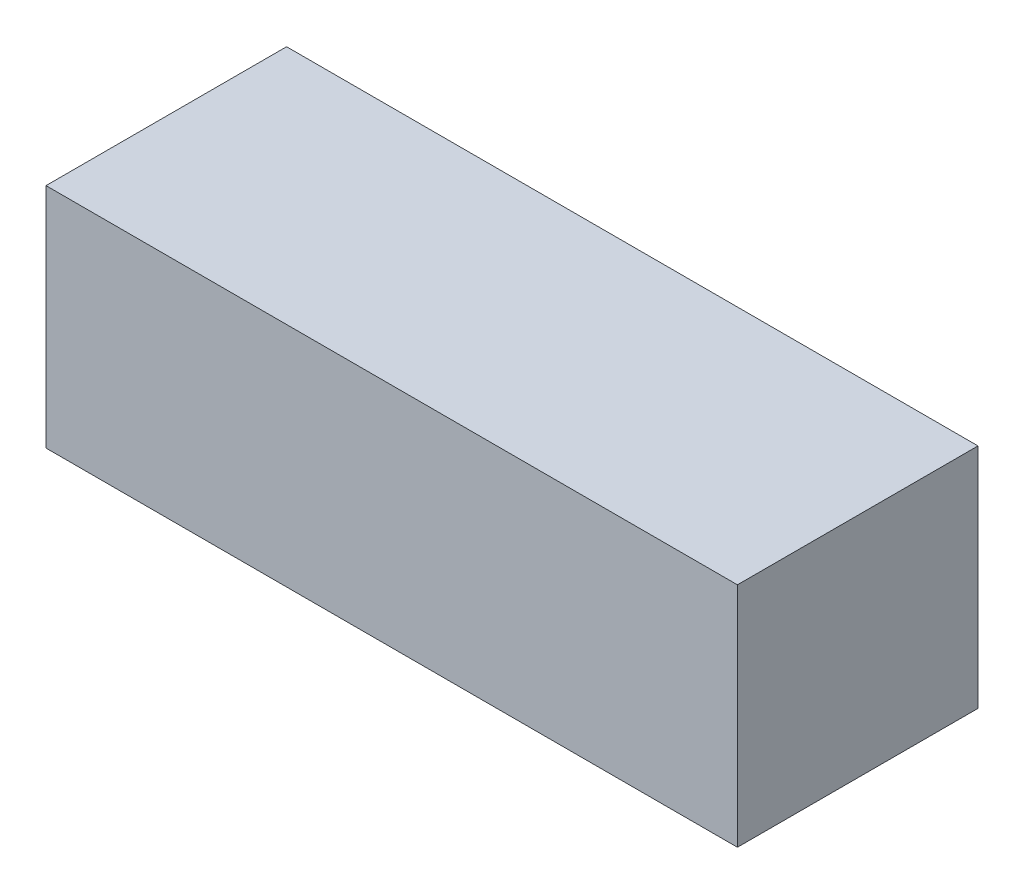
ISO-10303-21;
HEADER;
FILE_DESCRIPTION(('STEP AP214'),'2;1');
FILE_NAME('part.step','',(''),(''),'','','');
FILE_SCHEMA(('AUTOMOTIVE_DESIGN { 1 0 10303 214 1 1 1 1 }'));
ENDSEC;
DATA;
#1=APPLICATION_CONTEXT('core data for automotive mechanical design processes');
#2=APPLICATION_PROTOCOL_DEFINITION('international standard','automotive_design',2000,#1);
#3=PRODUCT_CONTEXT('',#1,'mechanical');
#4=PRODUCT('Part','Part','',(#3));
#5=PRODUCT_RELATED_PRODUCT_CATEGORY('part','',(#4));
#6=PRODUCT_DEFINITION_FORMATION('','',#4);
#7=PRODUCT_DEFINITION_CONTEXT('part definition',#1,'design');
#8=PRODUCT_DEFINITION('design','',#6,#7);
#9=PRODUCT_DEFINITION_SHAPE('','',#8);
#10=(LENGTH_UNIT() NAMED_UNIT(*) SI_UNIT(.MILLI.,.METRE.));
#11=(NAMED_UNIT(*) PLANE_ANGLE_UNIT() SI_UNIT($,.RADIAN.));
#12=(NAMED_UNIT(*) SI_UNIT($,.STERADIAN.) SOLID_ANGLE_UNIT());
#13=UNCERTAINTY_MEASURE_WITH_UNIT(LENGTH_MEASURE(1.E-05),#10,'distance_accuracy_value','');
#14=(GEOMETRIC_REPRESENTATION_CONTEXT(3) GLOBAL_UNCERTAINTY_ASSIGNED_CONTEXT((#13)) GLOBAL_UNIT_ASSIGNED_CONTEXT((#10,
#11,#12)) REPRESENTATION_CONTEXT('',''));
#15=CARTESIAN_POINT('',(0.,0.,0.));
#16=DIRECTION('',(0.,0.,1.));
#17=DIRECTION('',(1.,0.,0.));
#18=AXIS2_PLACEMENT_3D('',#15,#16,#17);
#19=CARTESIAN_POINT('',(-23.1775,-7.62,0.));
#20=DIRECTION('',(0.,1.,0.));
#21=DIRECTION('',(-1.,0.,0.));
#22=AXIS2_PLACEMENT_3D('',#19,#20,#21);
#23=PLANE('',#22);
#24=DIRECTION('',(0.,0.,1.));
#25=VECTOR('',#24,1.);
#26=CARTESIAN_POINT('',(23.1775,-7.62,0.));
#27=LINE('',#26,#25);
#28=CARTESIAN_POINT('',(23.1775,-7.62,0.));
#29=VERTEX_POINT('',#28);
#30=CARTESIAN_POINT('',(23.1775,-7.62,16.129));
#31=VERTEX_POINT('',#30);
#32=EDGE_CURVE('E20',#29,#31,#27,.T.);
#33=ORIENTED_EDGE('',*,*,#32,.T.);
#34=DIRECTION('',(-1.,0.,0.));
#35=VECTOR('',#34,1.);
#36=CARTESIAN_POINT('',(23.1775,-7.62,16.129));
#37=LINE('',#36,#35);
#38=CARTESIAN_POINT('',(-23.1775,-7.62,16.129));
#39=VERTEX_POINT('',#38);
#40=EDGE_CURVE('E55',#31,#39,#37,.T.);
#41=ORIENTED_EDGE('',*,*,#40,.T.);
#42=DIRECTION('',(0.,0.,-1.));
#43=VECTOR('',#42,1.);
#44=CARTESIAN_POINT('',(-23.1775,-7.62,0.));
#45=LINE('',#44,#43);
#46=CARTESIAN_POINT('',(-23.1775,-7.62,0.));
#47=VERTEX_POINT('',#46);
#48=EDGE_CURVE('E74',#39,#47,#45,.T.);
#49=ORIENTED_EDGE('',*,*,#48,.T.);
#50=DIRECTION('',(-1.,0.,0.));
#51=VECTOR('',#50,1.);
#52=CARTESIAN_POINT('',(23.1775,-7.62,0.));
#53=LINE('',#52,#51);
#54=EDGE_CURVE('E66',#29,#47,#53,.T.);
#55=ORIENTED_EDGE('',*,*,#54,.F.);
#56=EDGE_LOOP('',(#33,#41,#49,#55));
#57=FACE_BOUND('',#56,.T.);
#58=ADVANCED_FACE('F17',(#57),#23,.F.);
#59=CARTESIAN_POINT('',(23.1775,-7.62,0.));
#60=DIRECTION('',(-1.,0.,0.));
#61=DIRECTION('',(0.,0.,1.));
#62=AXIS2_PLACEMENT_3D('',#59,#60,#61);
#63=PLANE('',#62);
#64=DIRECTION('',(0.,0.,-1.));
#65=VECTOR('',#64,1.);
#66=CARTESIAN_POINT('',(23.1775,7.62,0.));
#67=LINE('',#66,#65);
#68=CARTESIAN_POINT('',(23.1775,7.62,0.));
#69=VERTEX_POINT('',#68);
#70=CARTESIAN_POINT('',(23.1775,7.62,16.129));
#71=VERTEX_POINT('',#70);
#72=EDGE_CURVE('E72',#69,#71,#67,.F.);
#73=ORIENTED_EDGE('',*,*,#72,.T.);
#74=DIRECTION('',(0.,1.,0.));
#75=VECTOR('',#74,1.);
#76=CARTESIAN_POINT('',(23.1775,-7.62,16.129));
#77=LINE('',#76,#75);
#78=EDGE_CURVE('E62',#71,#31,#77,.F.);
#79=ORIENTED_EDGE('',*,*,#78,.T.);
#80=ORIENTED_EDGE('',*,*,#32,.F.);
#81=DIRECTION('',(0.,1.,0.));
#82=VECTOR('',#81,1.);
#83=CARTESIAN_POINT('',(23.1775,-7.62,0.));
#84=LINE('',#83,#82);
#85=EDGE_CURVE('E80',#69,#29,#84,.F.);
#86=ORIENTED_EDGE('',*,*,#85,.F.);
#87=EDGE_LOOP('',(#73,#79,#80,#86));
#88=FACE_BOUND('',#87,.T.);
#89=ADVANCED_FACE('F71',(#88),#63,.F.);
#90=CARTESIAN_POINT('',(23.1775,-7.62,16.129));
#91=DIRECTION('',(0.,0.,-1.));
#92=DIRECTION('',(-1.,0.,0.));
#93=AXIS2_PLACEMENT_3D('',#90,#91,#92);
#94=PLANE('',#93);
#95=DIRECTION('',(1.,0.,0.));
#96=VECTOR('',#95,1.);
#97=CARTESIAN_POINT('',(23.1775,7.62,16.129));
#98=LINE('',#97,#96);
#99=CARTESIAN_POINT('',(-23.1775,7.62,16.129));
#100=VERTEX_POINT('',#99);
#101=EDGE_CURVE('E83',#71,#100,#98,.F.);
#102=ORIENTED_EDGE('',*,*,#101,.T.);
#103=DIRECTION('',(0.,1.,0.));
#104=VECTOR('',#103,1.);
#105=CARTESIAN_POINT('',(-23.1775,7.62,16.129));
#106=LINE('',#105,#104);
#107=EDGE_CURVE('E64',#100,#39,#106,.F.);
#108=ORIENTED_EDGE('',*,*,#107,.T.);
#109=ORIENTED_EDGE('',*,*,#40,.F.);
#110=ORIENTED_EDGE('',*,*,#78,.F.);
#111=EDGE_LOOP('',(#102,#108,#109,#110));
#112=FACE_BOUND('',#111,.T.);
#113=ADVANCED_FACE('F60',(#112),#94,.F.);
#114=CARTESIAN_POINT('',(-23.1775,7.62,0.));
#115=DIRECTION('',(1.,0.,0.));
#116=DIRECTION('',(0.,0.,-1.));
#117=AXIS2_PLACEMENT_3D('',#114,#115,#116);
#118=PLANE('',#117);
#119=ORIENTED_EDGE('',*,*,#48,.F.);
#120=ORIENTED_EDGE('',*,*,#107,.F.);
#121=DIRECTION('',(0.,0.,-1.));
#122=VECTOR('',#121,1.);
#123=CARTESIAN_POINT('',(-23.1775,7.62,0.));
#124=LINE('',#123,#122);
#125=CARTESIAN_POINT('',(-23.1775,7.62,0.));
#126=VERTEX_POINT('',#125);
#127=EDGE_CURVE('E26',#100,#126,#124,.T.);
#128=ORIENTED_EDGE('',*,*,#127,.T.);
#129=DIRECTION('',(0.,1.,0.));
#130=VECTOR('',#129,1.);
#131=CARTESIAN_POINT('',(-23.1775,-7.62,0.));
#132=LINE('',#131,#130);
#133=EDGE_CURVE('E34',#47,#126,#132,.T.);
#134=ORIENTED_EDGE('',*,*,#133,.F.);
#135=EDGE_LOOP('',(#119,#120,#128,#134));
#136=FACE_BOUND('',#135,.T.);
#137=ADVANCED_FACE('F88',(#136),#118,.F.);
#138=CARTESIAN_POINT('',(23.1775,-7.62,0.));
#139=DIRECTION('',(0.,0.,-1.));
#140=DIRECTION('',(-1.,0.,0.));
#141=AXIS2_PLACEMENT_3D('',#138,#139,#140);
#142=PLANE('',#141);
#143=DIRECTION('',(1.,0.,0.));
#144=VECTOR('',#143,1.);
#145=CARTESIAN_POINT('',(23.1775,7.62,0.));
#146=LINE('',#145,#144);
#147=EDGE_CURVE('E11',#126,#69,#146,.T.);
#148=ORIENTED_EDGE('',*,*,#147,.T.);
#149=ORIENTED_EDGE('',*,*,#85,.T.);
#150=ORIENTED_EDGE('',*,*,#54,.T.);
#151=ORIENTED_EDGE('',*,*,#133,.T.);
#152=EDGE_LOOP('',(#148,#149,#150,#151));
#153=FACE_BOUND('',#152,.T.);
#154=ADVANCED_FACE('F91',(#153),#142,.T.);
#155=CARTESIAN_POINT('',(23.1775,7.62,0.));
#156=DIRECTION('',(0.,-1.,0.));
#157=DIRECTION('',(0.,0.,-1.));
#158=AXIS2_PLACEMENT_3D('',#155,#156,#157);
#159=PLANE('',#158);
#160=ORIENTED_EDGE('',*,*,#127,.F.);
#161=ORIENTED_EDGE('',*,*,#101,.F.);
#162=ORIENTED_EDGE('',*,*,#72,.F.);
#163=ORIENTED_EDGE('',*,*,#147,.F.);
#164=EDGE_LOOP('',(#160,#161,#162,#163));
#165=FACE_BOUND('',#164,.T.);
#166=ADVANCED_FACE('F90',(#165),#159,.F.);
#167=CLOSED_SHELL('',(#58,#89,#113,#137,#154,#166));
#168=MANIFOLD_SOLID_BREP('B1',#167);
#169=ADVANCED_BREP_SHAPE_REPRESENTATION('',(#18,#168),#14);
#170=SHAPE_DEFINITION_REPRESENTATION(#9,#169);
ENDSEC;
END-ISO-10303-21;
